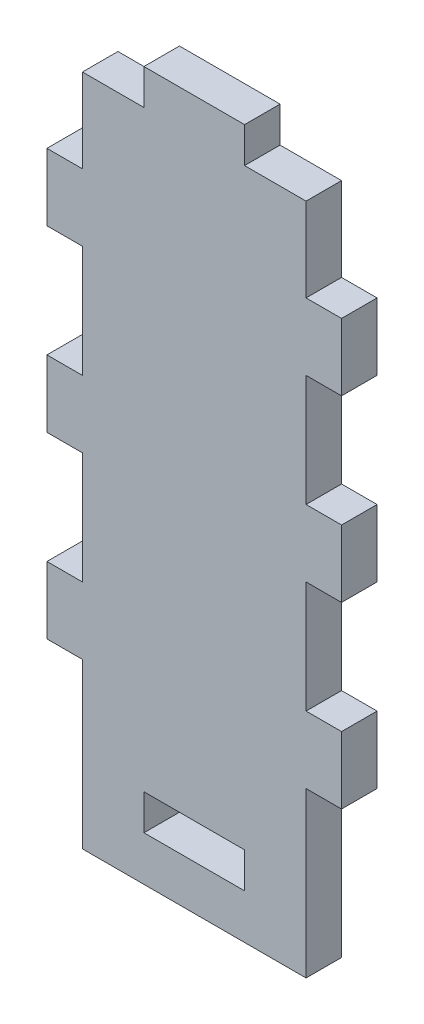
ISO-10303-21;
HEADER;
FILE_DESCRIPTION(('STEP AP214'),'2;1');
FILE_NAME('part.step','',(''),(''),'','','');
FILE_SCHEMA(('AUTOMOTIVE_DESIGN { 1 0 10303 214 1 1 1 1 }'));
ENDSEC;
DATA;
#1=APPLICATION_CONTEXT('core data for automotive mechanical design processes');
#2=APPLICATION_PROTOCOL_DEFINITION('international standard','automotive_design',2000,#1);
#3=PRODUCT_CONTEXT('',#1,'mechanical');
#4=PRODUCT('Part','Part','',(#3));
#5=PRODUCT_RELATED_PRODUCT_CATEGORY('part','',(#4));
#6=PRODUCT_DEFINITION_FORMATION('','',#4);
#7=PRODUCT_DEFINITION_CONTEXT('part definition',#1,'design');
#8=PRODUCT_DEFINITION('design','',#6,#7);
#9=PRODUCT_DEFINITION_SHAPE('','',#8);
#10=(LENGTH_UNIT() NAMED_UNIT(*) SI_UNIT(.MILLI.,.METRE.));
#11=(NAMED_UNIT(*) PLANE_ANGLE_UNIT() SI_UNIT($,.RADIAN.));
#12=(NAMED_UNIT(*) SI_UNIT($,.STERADIAN.) SOLID_ANGLE_UNIT());
#13=UNCERTAINTY_MEASURE_WITH_UNIT(LENGTH_MEASURE(1.E-05),#10,'distance_accuracy_value','');
#14=(GEOMETRIC_REPRESENTATION_CONTEXT(3) GLOBAL_UNCERTAINTY_ASSIGNED_CONTEXT((#13)) GLOBAL_UNIT_ASSIGNED_CONTEXT((#10,
#11,#12)) REPRESENTATION_CONTEXT('',''));
#15=CARTESIAN_POINT('',(0.,0.,0.));
#16=DIRECTION('',(0.,0.,1.));
#17=DIRECTION('',(1.,0.,0.));
#18=AXIS2_PLACEMENT_3D('',#15,#16,#17);
#19=CARTESIAN_POINT('',(0.,0.,1.5875));
#20=DIRECTION('',(1.,0.,0.));
#21=DIRECTION('',(0.,0.,-1.));
#22=AXIS2_PLACEMENT_3D('',#19,#20,#21);
#23=PLANE('',#22);
#24=DIRECTION('',(0.,-1.,0.));
#25=VECTOR('',#24,1.);
#26=CARTESIAN_POINT('',(0.,0.,-1.5875));
#27=LINE('',#26,#25);
#28=CARTESIAN_POINT('',(0.,14.675,-1.5875));
#29=VERTEX_POINT('',#28);
#30=CARTESIAN_POINT('',(0.,0.,-1.5875));
#31=VERTEX_POINT('',#30);
#32=EDGE_CURVE('E315',#29,#31,#27,.T.);
#33=ORIENTED_EDGE('',*,*,#32,.F.);
#34=DIRECTION('',(0.,0.,-1.));
#35=VECTOR('',#34,1.);
#36=CARTESIAN_POINT('',(0.,14.675,1.5875));
#37=LINE('',#36,#35);
#38=CARTESIAN_POINT('',(0.,14.675,1.5875));
#39=VERTEX_POINT('',#38);
#40=EDGE_CURVE('E11',#39,#29,#37,.T.);
#41=ORIENTED_EDGE('',*,*,#40,.F.);
#42=DIRECTION('',(0.,-1.,0.));
#43=VECTOR('',#42,1.);
#44=CARTESIAN_POINT('',(0.,0.,1.5875));
#45=LINE('',#44,#43);
#46=CARTESIAN_POINT('',(0.,0.,1.5875));
#47=VERTEX_POINT('',#46);
#48=EDGE_CURVE('E647',#39,#47,#45,.T.);
#49=ORIENTED_EDGE('',*,*,#48,.T.);
#50=DIRECTION('',(0.,0.,-1.));
#51=VECTOR('',#50,1.);
#52=CARTESIAN_POINT('',(0.,0.,1.5875));
#53=LINE('',#52,#51);
#54=EDGE_CURVE('E172',#47,#31,#53,.T.);
#55=ORIENTED_EDGE('',*,*,#54,.T.);
#56=EDGE_LOOP('',(#33,#41,#49,#55));
#57=FACE_BOUND('',#56,.T.);
#58=ADVANCED_FACE('F35',(#57),#23,.T.);
#59=CARTESIAN_POINT('',(0.,14.675,1.5875));
#60=DIRECTION('',(0.,1.,0.));
#61=DIRECTION('',(-1.,0.,0.));
#62=AXIS2_PLACEMENT_3D('',#59,#60,#61);
#63=PLANE('',#62);
#64=DIRECTION('',(1.,0.,0.));
#65=VECTOR('',#64,1.);
#66=CARTESIAN_POINT('',(0.,14.675,-1.5875));
#67=LINE('',#66,#65);
#68=CARTESIAN_POINT('',(3.175,14.675,-1.5875));
#69=VERTEX_POINT('',#68);
#70=EDGE_CURVE('E318',#29,#69,#67,.T.);
#71=ORIENTED_EDGE('',*,*,#70,.T.);
#72=DIRECTION('',(0.,0.,-1.));
#73=VECTOR('',#72,1.);
#74=CARTESIAN_POINT('',(3.175,14.675,1.5875));
#75=LINE('',#74,#73);
#76=CARTESIAN_POINT('',(3.175,14.675,1.5875));
#77=VERTEX_POINT('',#76);
#78=EDGE_CURVE('E45',#77,#69,#75,.T.);
#79=ORIENTED_EDGE('',*,*,#78,.F.);
#80=DIRECTION('',(1.,0.,0.));
#81=VECTOR('',#80,1.);
#82=CARTESIAN_POINT('',(0.,14.675,1.5875));
#83=LINE('',#82,#81);
#84=EDGE_CURVE('E649',#39,#77,#83,.T.);
#85=ORIENTED_EDGE('',*,*,#84,.F.);
#86=ORIENTED_EDGE('',*,*,#40,.T.);
#87=EDGE_LOOP('',(#71,#79,#85,#86));
#88=FACE_BOUND('',#87,.T.);
#89=ADVANCED_FACE('F513',(#88),#63,.F.);
#90=CARTESIAN_POINT('',(3.175,0.,1.5875));
#91=DIRECTION('',(-1.,0.,0.));
#92=DIRECTION('',(0.,0.,1.));
#93=AXIS2_PLACEMENT_3D('',#90,#91,#92);
#94=PLANE('',#93);
#95=DIRECTION('',(0.,1.,0.));
#96=VECTOR('',#95,1.);
#97=CARTESIAN_POINT('',(3.175,0.,-1.5875));
#98=LINE('',#97,#96);
#99=CARTESIAN_POINT('',(3.175,20.675,-1.5875));
#100=VERTEX_POINT('',#99);
#101=EDGE_CURVE('E321',#69,#100,#98,.T.);
#102=ORIENTED_EDGE('',*,*,#101,.T.);
#103=DIRECTION('',(0.,0.,-1.));
#104=VECTOR('',#103,1.);
#105=CARTESIAN_POINT('',(3.175,20.675,1.5875));
#106=LINE('',#105,#104);
#107=CARTESIAN_POINT('',(3.175,20.675,1.5875));
#108=VERTEX_POINT('',#107);
#109=EDGE_CURVE('E475',#108,#100,#106,.T.);
#110=ORIENTED_EDGE('',*,*,#109,.F.);
#111=DIRECTION('',(0.,1.,0.));
#112=VECTOR('',#111,1.);
#113=CARTESIAN_POINT('',(3.175,0.,1.5875));
#114=LINE('',#113,#112);
#115=EDGE_CURVE('E652',#77,#108,#114,.T.);
#116=ORIENTED_EDGE('',*,*,#115,.F.);
#117=ORIENTED_EDGE('',*,*,#78,.T.);
#118=EDGE_LOOP('',(#102,#110,#116,#117));
#119=FACE_BOUND('',#118,.T.);
#120=ADVANCED_FACE('F518',(#119),#94,.F.);
#121=CARTESIAN_POINT('',(0.,20.675,1.5875));
#122=DIRECTION('',(0.,-1.,0.));
#123=DIRECTION('',(1.,0.,0.));
#124=AXIS2_PLACEMENT_3D('',#121,#122,#123);
#125=PLANE('',#124);
#126=DIRECTION('',(-1.,0.,0.));
#127=VECTOR('',#126,1.);
#128=CARTESIAN_POINT('',(0.,20.675,-1.5875));
#129=LINE('',#128,#127);
#130=CARTESIAN_POINT('',(0.,20.675,-1.5875));
#131=VERTEX_POINT('',#130);
#132=EDGE_CURVE('E324',#100,#131,#129,.T.);
#133=ORIENTED_EDGE('',*,*,#132,.T.);
#134=DIRECTION('',(0.,0.,-1.));
#135=VECTOR('',#134,1.);
#136=CARTESIAN_POINT('',(0.,20.675,1.5875));
#137=LINE('',#136,#135);
#138=CARTESIAN_POINT('',(0.,20.675,1.5875));
#139=VERTEX_POINT('',#138);
#140=EDGE_CURVE('E472',#139,#131,#137,.T.);
#141=ORIENTED_EDGE('',*,*,#140,.F.);
#142=DIRECTION('',(-1.,0.,0.));
#143=VECTOR('',#142,1.);
#144=CARTESIAN_POINT('',(0.,20.675,1.5875));
#145=LINE('',#144,#143);
#146=EDGE_CURVE('E655',#108,#139,#145,.T.);
#147=ORIENTED_EDGE('',*,*,#146,.F.);
#148=ORIENTED_EDGE('',*,*,#109,.T.);
#149=EDGE_LOOP('',(#133,#141,#147,#148));
#150=FACE_BOUND('',#149,.T.);
#151=ADVANCED_FACE('F524',(#150),#125,.F.);
#152=CARTESIAN_POINT('',(0.,0.,1.5875));
#153=DIRECTION('',(-1.,0.,0.));
#154=DIRECTION('',(0.,0.,1.));
#155=AXIS2_PLACEMENT_3D('',#152,#153,#154);
#156=PLANE('',#155);
#157=DIRECTION('',(0.,1.,0.));
#158=VECTOR('',#157,1.);
#159=CARTESIAN_POINT('',(0.,0.,-1.5875));
#160=LINE('',#159,#158);
#161=CARTESIAN_POINT('',(0.,30.675,-1.5875));
#162=VERTEX_POINT('',#161);
#163=EDGE_CURVE('E327',#131,#162,#160,.T.);
#164=ORIENTED_EDGE('',*,*,#163,.T.);
#165=DIRECTION('',(0.,0.,-1.));
#166=VECTOR('',#165,1.);
#167=CARTESIAN_POINT('',(0.,30.675,1.5875));
#168=LINE('',#167,#166);
#169=CARTESIAN_POINT('',(0.,30.675,1.5875));
#170=VERTEX_POINT('',#169);
#171=EDGE_CURVE('E469',#170,#162,#168,.T.);
#172=ORIENTED_EDGE('',*,*,#171,.F.);
#173=DIRECTION('',(0.,1.,0.));
#174=VECTOR('',#173,1.);
#175=CARTESIAN_POINT('',(0.,0.,1.5875));
#176=LINE('',#175,#174);
#177=EDGE_CURVE('E658',#139,#170,#176,.T.);
#178=ORIENTED_EDGE('',*,*,#177,.F.);
#179=ORIENTED_EDGE('',*,*,#140,.T.);
#180=EDGE_LOOP('',(#164,#172,#178,#179));
#181=FACE_BOUND('',#180,.T.);
#182=ADVANCED_FACE('F528',(#181),#156,.F.);
#183=CARTESIAN_POINT('',(0.,30.675,1.5875));
#184=DIRECTION('',(0.,1.,0.));
#185=DIRECTION('',(0.,0.,1.));
#186=AXIS2_PLACEMENT_3D('',#183,#184,#185);
#187=PLANE('',#186);
#188=DIRECTION('',(1.,0.,0.));
#189=VECTOR('',#188,1.);
#190=CARTESIAN_POINT('',(0.,30.675,-1.5875));
#191=LINE('',#190,#189);
#192=CARTESIAN_POINT('',(3.175,30.675,-1.5875));
#193=VERTEX_POINT('',#192);
#194=EDGE_CURVE('E330',#162,#193,#191,.T.);
#195=ORIENTED_EDGE('',*,*,#194,.T.);
#196=DIRECTION('',(0.,0.,-1.));
#197=VECTOR('',#196,1.);
#198=CARTESIAN_POINT('',(3.175,30.675,1.5875));
#199=LINE('',#198,#197);
#200=CARTESIAN_POINT('',(3.175,30.675,1.5875));
#201=VERTEX_POINT('',#200);
#202=EDGE_CURVE('E466',#201,#193,#199,.T.);
#203=ORIENTED_EDGE('',*,*,#202,.F.);
#204=DIRECTION('',(1.,0.,0.));
#205=VECTOR('',#204,1.);
#206=CARTESIAN_POINT('',(0.,30.675,1.5875));
#207=LINE('',#206,#205);
#208=EDGE_CURVE('E661',#170,#201,#207,.T.);
#209=ORIENTED_EDGE('',*,*,#208,.F.);
#210=ORIENTED_EDGE('',*,*,#171,.T.);
#211=EDGE_LOOP('',(#195,#203,#209,#210));
#212=FACE_BOUND('',#211,.T.);
#213=ADVANCED_FACE('F532',(#212),#187,.F.);
#214=CARTESIAN_POINT('',(3.175,0.,1.5875));
#215=DIRECTION('',(-1.,0.,0.));
#216=DIRECTION('',(0.,0.,1.));
#217=AXIS2_PLACEMENT_3D('',#214,#215,#216);
#218=PLANE('',#217);
#219=DIRECTION('',(0.,1.,0.));
#220=VECTOR('',#219,1.);
#221=CARTESIAN_POINT('',(3.175,0.,-1.5875));
#222=LINE('',#221,#220);
#223=CARTESIAN_POINT('',(3.175,36.675,-1.5875));
#224=VERTEX_POINT('',#223);
#225=EDGE_CURVE('E333',#193,#224,#222,.T.);
#226=ORIENTED_EDGE('',*,*,#225,.T.);
#227=DIRECTION('',(0.,0.,-1.));
#228=VECTOR('',#227,1.);
#229=CARTESIAN_POINT('',(3.175,36.675,1.5875));
#230=LINE('',#229,#228);
#231=CARTESIAN_POINT('',(3.175,36.675,1.5875));
#232=VERTEX_POINT('',#231);
#233=EDGE_CURVE('E463',#232,#224,#230,.T.);
#234=ORIENTED_EDGE('',*,*,#233,.F.);
#235=DIRECTION('',(0.,1.,0.));
#236=VECTOR('',#235,1.);
#237=CARTESIAN_POINT('',(3.175,0.,1.5875));
#238=LINE('',#237,#236);
#239=EDGE_CURVE('E664',#201,#232,#238,.T.);
#240=ORIENTED_EDGE('',*,*,#239,.F.);
#241=ORIENTED_EDGE('',*,*,#202,.T.);
#242=EDGE_LOOP('',(#226,#234,#240,#241));
#243=FACE_BOUND('',#242,.T.);
#244=ADVANCED_FACE('F536',(#243),#218,.F.);
#245=CARTESIAN_POINT('',(0.,36.675,1.5875));
#246=DIRECTION('',(0.,-1.,0.));
#247=DIRECTION('',(0.,0.,-1.));
#248=AXIS2_PLACEMENT_3D('',#245,#246,#247);
#249=PLANE('',#248);
#250=DIRECTION('',(-1.,0.,0.));
#251=VECTOR('',#250,1.);
#252=CARTESIAN_POINT('',(0.,36.675,-1.5875));
#253=LINE('',#252,#251);
#254=CARTESIAN_POINT('',(0.,36.675,-1.5875));
#255=VERTEX_POINT('',#254);
#256=EDGE_CURVE('E336',#224,#255,#253,.T.);
#257=ORIENTED_EDGE('',*,*,#256,.T.);
#258=DIRECTION('',(0.,0.,-1.));
#259=VECTOR('',#258,1.);
#260=CARTESIAN_POINT('',(0.,36.675,1.5875));
#261=LINE('',#260,#259);
#262=CARTESIAN_POINT('',(0.,36.675,1.5875));
#263=VERTEX_POINT('',#262);
#264=EDGE_CURVE('E460',#263,#255,#261,.T.);
#265=ORIENTED_EDGE('',*,*,#264,.F.);
#266=DIRECTION('',(-1.,0.,0.));
#267=VECTOR('',#266,1.);
#268=CARTESIAN_POINT('',(0.,36.675,1.5875));
#269=LINE('',#268,#267);
#270=EDGE_CURVE('E667',#232,#263,#269,.T.);
#271=ORIENTED_EDGE('',*,*,#270,.F.);
#272=ORIENTED_EDGE('',*,*,#233,.T.);
#273=EDGE_LOOP('',(#257,#265,#271,#272));
#274=FACE_BOUND('',#273,.T.);
#275=ADVANCED_FACE('F540',(#274),#249,.F.);
#276=CARTESIAN_POINT('',(0.,0.,1.5875));
#277=DIRECTION('',(-1.,0.,0.));
#278=DIRECTION('',(0.,0.,1.));
#279=AXIS2_PLACEMENT_3D('',#276,#277,#278);
#280=PLANE('',#279);
#281=DIRECTION('',(0.,1.,0.));
#282=VECTOR('',#281,1.);
#283=CARTESIAN_POINT('',(0.,0.,-1.5875));
#284=LINE('',#283,#282);
#285=CARTESIAN_POINT('',(0.,46.675,-1.5875));
#286=VERTEX_POINT('',#285);
#287=EDGE_CURVE('E339',#255,#286,#284,.T.);
#288=ORIENTED_EDGE('',*,*,#287,.T.);
#289=DIRECTION('',(0.,0.,-1.));
#290=VECTOR('',#289,1.);
#291=CARTESIAN_POINT('',(0.,46.675,1.5875));
#292=LINE('',#291,#290);
#293=CARTESIAN_POINT('',(0.,46.675,1.5875));
#294=VERTEX_POINT('',#293);
#295=EDGE_CURVE('E457',#294,#286,#292,.T.);
#296=ORIENTED_EDGE('',*,*,#295,.F.);
#297=DIRECTION('',(0.,1.,0.));
#298=VECTOR('',#297,1.);
#299=CARTESIAN_POINT('',(0.,0.,1.5875));
#300=LINE('',#299,#298);
#301=EDGE_CURVE('E670',#263,#294,#300,.T.);
#302=ORIENTED_EDGE('',*,*,#301,.F.);
#303=ORIENTED_EDGE('',*,*,#264,.T.);
#304=EDGE_LOOP('',(#288,#296,#302,#303));
#305=FACE_BOUND('',#304,.T.);
#306=ADVANCED_FACE('F544',(#305),#280,.F.);
#307=CARTESIAN_POINT('',(1.02007204083424E-13,46.675,1.5875));
#308=DIRECTION('',(0.,1.,0.));
#309=DIRECTION('',(-1.,0.,0.));
#310=AXIS2_PLACEMENT_3D('',#307,#308,#309);
#311=PLANE('',#310);
#312=DIRECTION('',(1.,0.,0.));
#313=VECTOR('',#312,1.);
#314=CARTESIAN_POINT('',(1.02007204083424E-13,46.675,-1.5875));
#315=LINE('',#314,#313);
#316=CARTESIAN_POINT('',(3.175,46.675,-1.5875));
#317=VERTEX_POINT('',#316);
#318=EDGE_CURVE('E342',#286,#317,#315,.T.);
#319=ORIENTED_EDGE('',*,*,#318,.T.);
#320=DIRECTION('',(0.,0.,-1.));
#321=VECTOR('',#320,1.);
#322=CARTESIAN_POINT('',(3.175,46.675,1.5875));
#323=LINE('',#322,#321);
#324=CARTESIAN_POINT('',(3.175,46.675,1.5875));
#325=VERTEX_POINT('',#324);
#326=EDGE_CURVE('E454',#325,#317,#323,.T.);
#327=ORIENTED_EDGE('',*,*,#326,.F.);
#328=DIRECTION('',(1.,0.,0.));
#329=VECTOR('',#328,1.);
#330=CARTESIAN_POINT('',(1.02007204083424E-13,46.675,1.5875));
#331=LINE('',#330,#329);
#332=EDGE_CURVE('E673',#294,#325,#331,.T.);
#333=ORIENTED_EDGE('',*,*,#332,.F.);
#334=ORIENTED_EDGE('',*,*,#295,.T.);
#335=EDGE_LOOP('',(#319,#327,#333,#334));
#336=FACE_BOUND('',#335,.T.);
#337=ADVANCED_FACE('F548',(#336),#311,.F.);
#338=CARTESIAN_POINT('',(3.175,0.,1.5875));
#339=DIRECTION('',(-1.,0.,0.));
#340=DIRECTION('',(0.,0.,1.));
#341=AXIS2_PLACEMENT_3D('',#338,#339,#340);
#342=PLANE('',#341);
#343=DIRECTION('',(0.,1.,0.));
#344=VECTOR('',#343,1.);
#345=CARTESIAN_POINT('',(3.175,0.,-1.5875));
#346=LINE('',#345,#344);
#347=CARTESIAN_POINT('',(3.175,52.675,-1.5875));
#348=VERTEX_POINT('',#347);
#349=EDGE_CURVE('E345',#317,#348,#346,.T.);
#350=ORIENTED_EDGE('',*,*,#349,.T.);
#351=DIRECTION('',(0.,0.,-1.));
#352=VECTOR('',#351,1.);
#353=CARTESIAN_POINT('',(3.175,52.675,1.5875));
#354=LINE('',#353,#352);
#355=CARTESIAN_POINT('',(3.175,52.675,1.5875));
#356=VERTEX_POINT('',#355);
#357=EDGE_CURVE('E451',#356,#348,#354,.T.);
#358=ORIENTED_EDGE('',*,*,#357,.F.);
#359=DIRECTION('',(0.,1.,0.));
#360=VECTOR('',#359,1.);
#361=CARTESIAN_POINT('',(3.175,0.,1.5875));
#362=LINE('',#361,#360);
#363=EDGE_CURVE('E676',#325,#356,#362,.T.);
#364=ORIENTED_EDGE('',*,*,#363,.F.);
#365=ORIENTED_EDGE('',*,*,#326,.T.);
#366=EDGE_LOOP('',(#350,#358,#364,#365));
#367=FACE_BOUND('',#366,.T.);
#368=ADVANCED_FACE('F552',(#367),#342,.F.);
#369=CARTESIAN_POINT('',(-1.15120074453012E-13,52.675,1.5875));
#370=DIRECTION('',(0.,-1.,0.));
#371=DIRECTION('',(1.,0.,0.));
#372=AXIS2_PLACEMENT_3D('',#369,#370,#371);
#373=PLANE('',#372);
#374=DIRECTION('',(-1.,0.,0.));
#375=VECTOR('',#374,1.);
#376=CARTESIAN_POINT('',(-1.15120074453012E-13,52.675,-1.5875));
#377=LINE('',#376,#375);
#378=CARTESIAN_POINT('',(0.,52.675,-1.5875));
#379=VERTEX_POINT('',#378);
#380=EDGE_CURVE('E348',#348,#379,#377,.T.);
#381=ORIENTED_EDGE('',*,*,#380,.T.);
#382=DIRECTION('',(0.,0.,-1.));
#383=VECTOR('',#382,1.);
#384=CARTESIAN_POINT('',(0.,52.675,1.5875));
#385=LINE('',#384,#383);
#386=CARTESIAN_POINT('',(0.,52.675,1.5875));
#387=VERTEX_POINT('',#386);
#388=EDGE_CURVE('E448',#387,#379,#385,.T.);
#389=ORIENTED_EDGE('',*,*,#388,.F.);
#390=DIRECTION('',(-1.,0.,0.));
#391=VECTOR('',#390,1.);
#392=CARTESIAN_POINT('',(-1.15120074453012E-13,52.675,1.5875));
#393=LINE('',#392,#391);
#394=EDGE_CURVE('E679',#356,#387,#393,.T.);
#395=ORIENTED_EDGE('',*,*,#394,.F.);
#396=ORIENTED_EDGE('',*,*,#357,.T.);
#397=EDGE_LOOP('',(#381,#389,#395,#396));
#398=FACE_BOUND('',#397,.T.);
#399=ADVANCED_FACE('F556',(#398),#373,.F.);
#400=CARTESIAN_POINT('',(0.,0.,1.5875));
#401=DIRECTION('',(-1.,0.,0.));
#402=DIRECTION('',(0.,-1.,0.));
#403=AXIS2_PLACEMENT_3D('',#400,#401,#402);
#404=PLANE('',#403);
#405=DIRECTION('',(0.,1.,0.));
#406=VECTOR('',#405,1.);
#407=CARTESIAN_POINT('',(0.,0.,-1.5875));
#408=LINE('',#407,#406);
#409=CARTESIAN_POINT('',(0.,60.175,-1.5875));
#410=VERTEX_POINT('',#409);
#411=EDGE_CURVE('E351',#379,#410,#408,.T.);
#412=ORIENTED_EDGE('',*,*,#411,.T.);
#413=DIRECTION('',(0.,0.,-1.));
#414=VECTOR('',#413,1.);
#415=CARTESIAN_POINT('',(0.,60.175,1.5875));
#416=LINE('',#415,#414);
#417=CARTESIAN_POINT('',(0.,60.175,1.5875));
#418=VERTEX_POINT('',#417);
#419=EDGE_CURVE('E445',#418,#410,#416,.T.);
#420=ORIENTED_EDGE('',*,*,#419,.F.);
#421=DIRECTION('',(0.,1.,0.));
#422=VECTOR('',#421,1.);
#423=CARTESIAN_POINT('',(0.,0.,1.5875));
#424=LINE('',#423,#422);
#425=EDGE_CURVE('E682',#387,#418,#424,.T.);
#426=ORIENTED_EDGE('',*,*,#425,.F.);
#427=ORIENTED_EDGE('',*,*,#388,.T.);
#428=EDGE_LOOP('',(#412,#420,#426,#427));
#429=FACE_BOUND('',#428,.T.);
#430=ADVANCED_FACE('F560',(#429),#404,.F.);
#431=CARTESIAN_POINT('',(-2.27753422182337E-13,60.175,1.5875));
#432=DIRECTION('',(0.,-1.,0.));
#433=DIRECTION('',(1.,0.,0.));
#434=AXIS2_PLACEMENT_3D('',#431,#432,#433);
#435=PLANE('',#434);
#436=DIRECTION('',(-1.,0.,0.));
#437=VECTOR('',#436,1.);
#438=CARTESIAN_POINT('',(-2.27753422182337E-13,60.175,-1.5875));
#439=LINE('',#438,#437);
#440=CARTESIAN_POINT('',(-5.50000000000001,60.175,-1.5875));
#441=VERTEX_POINT('',#440);
#442=EDGE_CURVE('E354',#410,#441,#439,.T.);
#443=ORIENTED_EDGE('',*,*,#442,.T.);
#444=DIRECTION('',(0.,0.,-1.));
#445=VECTOR('',#444,1.);
#446=CARTESIAN_POINT('',(-5.50000000000001,60.175,1.5875));
#447=LINE('',#446,#445);
#448=CARTESIAN_POINT('',(-5.50000000000001,60.175,1.5875));
#449=VERTEX_POINT('',#448);
#450=EDGE_CURVE('E442',#449,#441,#447,.T.);
#451=ORIENTED_EDGE('',*,*,#450,.F.);
#452=DIRECTION('',(-1.,0.,0.));
#453=VECTOR('',#452,1.);
#454=CARTESIAN_POINT('',(-2.27753422182337E-13,60.175,1.5875));
#455=LINE('',#454,#453);
#456=EDGE_CURVE('E685',#418,#449,#455,.T.);
#457=ORIENTED_EDGE('',*,*,#456,.F.);
#458=ORIENTED_EDGE('',*,*,#419,.T.);
#459=EDGE_LOOP('',(#443,#451,#457,#458));
#460=FACE_BOUND('',#459,.T.);
#461=ADVANCED_FACE('F564',(#460),#435,.F.);
#462=CARTESIAN_POINT('',(-5.49999999999994,0.,1.5875));
#463=DIRECTION('',(-1.,0.,0.));
#464=DIRECTION('',(0.,-1.,0.));
#465=AXIS2_PLACEMENT_3D('',#462,#463,#464);
#466=PLANE('',#465);
#467=DIRECTION('',(0.,1.,0.));
#468=VECTOR('',#467,1.);
#469=CARTESIAN_POINT('',(-5.49999999999994,0.,-1.5875));
#470=LINE('',#469,#468);
#471=CARTESIAN_POINT('',(-5.50000000000001,63.35,-1.5875));
#472=VERTEX_POINT('',#471);
#473=EDGE_CURVE('E357',#441,#472,#470,.T.);
#474=ORIENTED_EDGE('',*,*,#473,.T.);
#475=DIRECTION('',(0.,0.,-1.));
#476=VECTOR('',#475,1.);
#477=CARTESIAN_POINT('',(-5.50000000000001,63.35,1.5875));
#478=LINE('',#477,#476);
#479=CARTESIAN_POINT('',(-5.50000000000001,63.35,1.5875));
#480=VERTEX_POINT('',#479);
#481=EDGE_CURVE('E439',#480,#472,#478,.T.);
#482=ORIENTED_EDGE('',*,*,#481,.F.);
#483=DIRECTION('',(0.,1.,0.));
#484=VECTOR('',#483,1.);
#485=CARTESIAN_POINT('',(-5.49999999999994,0.,1.5875));
#486=LINE('',#485,#484);
#487=EDGE_CURVE('E688',#449,#480,#486,.T.);
#488=ORIENTED_EDGE('',*,*,#487,.F.);
#489=ORIENTED_EDGE('',*,*,#450,.T.);
#490=EDGE_LOOP('',(#474,#482,#488,#489));
#491=FACE_BOUND('',#490,.T.);
#492=ADVANCED_FACE('F568',(#491),#466,.F.);
#493=CARTESIAN_POINT('',(0.,63.35,1.5875));
#494=DIRECTION('',(0.,-1.,0.));
#495=DIRECTION('',(0.,0.,-1.));
#496=AXIS2_PLACEMENT_3D('',#493,#494,#495);
#497=PLANE('',#496);
#498=DIRECTION('',(-1.,0.,0.));
#499=VECTOR('',#498,1.);
#500=CARTESIAN_POINT('',(0.,63.35,-1.5875));
#501=LINE('',#500,#499);
#502=CARTESIAN_POINT('',(-14.5,63.35,-1.5875));
#503=VERTEX_POINT('',#502);
#504=EDGE_CURVE('E360',#472,#503,#501,.T.);
#505=ORIENTED_EDGE('',*,*,#504,.T.);
#506=DIRECTION('',(0.,0.,-1.));
#507=VECTOR('',#506,1.);
#508=CARTESIAN_POINT('',(-14.5,63.35,1.5875));
#509=LINE('',#508,#507);
#510=CARTESIAN_POINT('',(-14.5,63.35,1.5875));
#511=VERTEX_POINT('',#510);
#512=EDGE_CURVE('E436',#511,#503,#509,.T.);
#513=ORIENTED_EDGE('',*,*,#512,.F.);
#514=DIRECTION('',(-1.,0.,0.));
#515=VECTOR('',#514,1.);
#516=CARTESIAN_POINT('',(0.,63.35,1.5875));
#517=LINE('',#516,#515);
#518=EDGE_CURVE('E691',#480,#511,#517,.T.);
#519=ORIENTED_EDGE('',*,*,#518,.F.);
#520=ORIENTED_EDGE('',*,*,#481,.T.);
#521=EDGE_LOOP('',(#505,#513,#519,#520));
#522=FACE_BOUND('',#521,.T.);
#523=ADVANCED_FACE('F572',(#522),#497,.F.);
#524=CARTESIAN_POINT('',(-14.5,0.,1.5875));
#525=DIRECTION('',(1.,0.,0.));
#526=DIRECTION('',(0.,0.,-1.));
#527=AXIS2_PLACEMENT_3D('',#524,#525,#526);
#528=PLANE('',#527);
#529=DIRECTION('',(0.,-1.,0.));
#530=VECTOR('',#529,1.);
#531=CARTESIAN_POINT('',(-14.5,0.,-1.5875));
#532=LINE('',#531,#530);
#533=CARTESIAN_POINT('',(-14.5,60.175,-1.5875));
#534=VERTEX_POINT('',#533);
#535=EDGE_CURVE('E363',#503,#534,#532,.T.);
#536=ORIENTED_EDGE('',*,*,#535,.T.);
#537=DIRECTION('',(0.,0.,-1.));
#538=VECTOR('',#537,1.);
#539=CARTESIAN_POINT('',(-14.5,60.175,1.5875));
#540=LINE('',#539,#538);
#541=CARTESIAN_POINT('',(-14.5,60.175,1.5875));
#542=VERTEX_POINT('',#541);
#543=EDGE_CURVE('E433',#542,#534,#540,.T.);
#544=ORIENTED_EDGE('',*,*,#543,.F.);
#545=DIRECTION('',(0.,-1.,0.));
#546=VECTOR('',#545,1.);
#547=CARTESIAN_POINT('',(-14.5,0.,1.5875));
#548=LINE('',#547,#546);
#549=EDGE_CURVE('E694',#511,#542,#548,.T.);
#550=ORIENTED_EDGE('',*,*,#549,.F.);
#551=ORIENTED_EDGE('',*,*,#512,.T.);
#552=EDGE_LOOP('',(#536,#544,#550,#551));
#553=FACE_BOUND('',#552,.T.);
#554=ADVANCED_FACE('F576',(#553),#528,.F.);
#555=CARTESIAN_POINT('',(0.,60.175,1.5875));
#556=DIRECTION('',(0.,-1.,0.));
#557=DIRECTION('',(0.,0.,-1.));
#558=AXIS2_PLACEMENT_3D('',#555,#556,#557);
#559=PLANE('',#558);
#560=DIRECTION('',(-1.,0.,0.));
#561=VECTOR('',#560,1.);
#562=CARTESIAN_POINT('',(0.,60.175,-1.5875));
#563=LINE('',#562,#561);
#564=CARTESIAN_POINT('',(-20.,60.175,-1.5875));
#565=VERTEX_POINT('',#564);
#566=EDGE_CURVE('E366',#534,#565,#563,.T.);
#567=ORIENTED_EDGE('',*,*,#566,.T.);
#568=DIRECTION('',(0.,0.,-1.));
#569=VECTOR('',#568,1.);
#570=CARTESIAN_POINT('',(-20.,60.175,1.5875));
#571=LINE('',#570,#569);
#572=CARTESIAN_POINT('',(-20.,60.175,1.5875));
#573=VERTEX_POINT('',#572);
#574=EDGE_CURVE('E431',#573,#565,#571,.T.);
#575=ORIENTED_EDGE('',*,*,#574,.F.);
#576=DIRECTION('',(-1.,0.,0.));
#577=VECTOR('',#576,1.);
#578=CARTESIAN_POINT('',(0.,60.175,1.5875));
#579=LINE('',#578,#577);
#580=EDGE_CURVE('E697',#542,#573,#579,.T.);
#581=ORIENTED_EDGE('',*,*,#580,.F.);
#582=ORIENTED_EDGE('',*,*,#543,.T.);
#583=EDGE_LOOP('',(#567,#575,#581,#582));
#584=FACE_BOUND('',#583,.T.);
#585=ADVANCED_FACE('F580',(#584),#559,.F.);
#586=CARTESIAN_POINT('',(-20.,0.,1.5875));
#587=DIRECTION('',(-1.,0.,0.));
#588=DIRECTION('',(0.,0.,1.));
#589=AXIS2_PLACEMENT_3D('',#586,#587,#588);
#590=PLANE('',#589);
#591=DIRECTION('',(0.,1.,0.));
#592=VECTOR('',#591,1.);
#593=CARTESIAN_POINT('',(-20.,0.,-1.5875));
#594=LINE('',#593,#592);
#595=CARTESIAN_POINT('',(-20.,52.675,-1.5875));
#596=VERTEX_POINT('',#595);
#597=EDGE_CURVE('E369',#596,#565,#594,.T.);
#598=ORIENTED_EDGE('',*,*,#597,.F.);
#599=DIRECTION('',(0.,0.,-1.));
#600=VECTOR('',#599,1.);
#601=CARTESIAN_POINT('',(-20.,52.675,1.5875));
#602=LINE('',#601,#600);
#603=CARTESIAN_POINT('',(-20.,52.675,1.5875));
#604=VERTEX_POINT('',#603);
#605=EDGE_CURVE('E429',#604,#596,#602,.T.);
#606=ORIENTED_EDGE('',*,*,#605,.F.);
#607=DIRECTION('',(0.,1.,0.));
#608=VECTOR('',#607,1.);
#609=CARTESIAN_POINT('',(-20.,0.,1.5875));
#610=LINE('',#609,#608);
#611=EDGE_CURVE('E699',#604,#573,#610,.T.);
#612=ORIENTED_EDGE('',*,*,#611,.T.);
#613=ORIENTED_EDGE('',*,*,#574,.T.);
#614=EDGE_LOOP('',(#598,#606,#612,#613));
#615=FACE_BOUND('',#614,.T.);
#616=ADVANCED_FACE('F584',(#615),#590,.T.);
#617=CARTESIAN_POINT('',(0.,52.675,1.5875));
#618=DIRECTION('',(0.,1.,0.));
#619=DIRECTION('',(0.,0.,1.));
#620=AXIS2_PLACEMENT_3D('',#617,#618,#619);
#621=PLANE('',#620);
#622=DIRECTION('',(1.,0.,0.));
#623=VECTOR('',#622,1.);
#624=CARTESIAN_POINT('',(0.,52.675,-1.5875));
#625=LINE('',#624,#623);
#626=CARTESIAN_POINT('',(-23.175,52.675,-1.5875));
#627=VERTEX_POINT('',#626);
#628=EDGE_CURVE('E372',#627,#596,#625,.T.);
#629=ORIENTED_EDGE('',*,*,#628,.F.);
#630=DIRECTION('',(0.,0.,-1.));
#631=VECTOR('',#630,1.);
#632=CARTESIAN_POINT('',(-23.175,52.675,1.5875));
#633=LINE('',#632,#631);
#634=CARTESIAN_POINT('',(-23.175,52.675,1.5875));
#635=VERTEX_POINT('',#634);
#636=EDGE_CURVE('E427',#635,#627,#633,.T.);
#637=ORIENTED_EDGE('',*,*,#636,.F.);
#638=DIRECTION('',(1.,0.,0.));
#639=VECTOR('',#638,1.);
#640=CARTESIAN_POINT('',(0.,52.675,1.5875));
#641=LINE('',#640,#639);
#642=EDGE_CURVE('E702',#635,#604,#641,.T.);
#643=ORIENTED_EDGE('',*,*,#642,.T.);
#644=ORIENTED_EDGE('',*,*,#605,.T.);
#645=EDGE_LOOP('',(#629,#637,#643,#644));
#646=FACE_BOUND('',#645,.T.);
#647=ADVANCED_FACE('F588',(#646),#621,.T.);
#648=CARTESIAN_POINT('',(-23.175,0.,1.5875));
#649=DIRECTION('',(-1.,0.,0.));
#650=DIRECTION('',(0.,0.,1.));
#651=AXIS2_PLACEMENT_3D('',#648,#649,#650);
#652=PLANE('',#651);
#653=DIRECTION('',(0.,1.,0.));
#654=VECTOR('',#653,1.);
#655=CARTESIAN_POINT('',(-23.175,0.,-1.5875));
#656=LINE('',#655,#654);
#657=CARTESIAN_POINT('',(-23.175,46.675,-1.5875));
#658=VERTEX_POINT('',#657);
#659=EDGE_CURVE('E375',#658,#627,#656,.T.);
#660=ORIENTED_EDGE('',*,*,#659,.F.);
#661=DIRECTION('',(0.,0.,-1.));
#662=VECTOR('',#661,1.);
#663=CARTESIAN_POINT('',(-23.175,46.675,1.5875));
#664=LINE('',#663,#662);
#665=CARTESIAN_POINT('',(-23.175,46.675,1.5875));
#666=VERTEX_POINT('',#665);
#667=EDGE_CURVE('E425',#666,#658,#664,.T.);
#668=ORIENTED_EDGE('',*,*,#667,.F.);
#669=DIRECTION('',(0.,1.,0.));
#670=VECTOR('',#669,1.);
#671=CARTESIAN_POINT('',(-23.175,0.,1.5875));
#672=LINE('',#671,#670);
#673=EDGE_CURVE('E705',#666,#635,#672,.T.);
#674=ORIENTED_EDGE('',*,*,#673,.T.);
#675=ORIENTED_EDGE('',*,*,#636,.T.);
#676=EDGE_LOOP('',(#660,#668,#674,#675));
#677=FACE_BOUND('',#676,.T.);
#678=ADVANCED_FACE('F592',(#677),#652,.T.);
#679=CARTESIAN_POINT('',(0.,46.675,1.5875));
#680=DIRECTION('',(0.,-1.,0.));
#681=DIRECTION('',(0.,0.,-1.));
#682=AXIS2_PLACEMENT_3D('',#679,#680,#681);
#683=PLANE('',#682);
#684=DIRECTION('',(-1.,0.,0.));
#685=VECTOR('',#684,1.);
#686=CARTESIAN_POINT('',(0.,46.675,-1.5875));
#687=LINE('',#686,#685);
#688=CARTESIAN_POINT('',(-20.,46.675,-1.5875));
#689=VERTEX_POINT('',#688);
#690=EDGE_CURVE('E378',#689,#658,#687,.T.);
#691=ORIENTED_EDGE('',*,*,#690,.F.);
#692=DIRECTION('',(0.,0.,-1.));
#693=VECTOR('',#692,1.);
#694=CARTESIAN_POINT('',(-20.,46.675,1.5875));
#695=LINE('',#694,#693);
#696=CARTESIAN_POINT('',(-20.,46.675,1.5875));
#697=VERTEX_POINT('',#696);
#698=EDGE_CURVE('E423',#697,#689,#695,.T.);
#699=ORIENTED_EDGE('',*,*,#698,.F.);
#700=DIRECTION('',(-1.,0.,0.));
#701=VECTOR('',#700,1.);
#702=CARTESIAN_POINT('',(0.,46.675,1.5875));
#703=LINE('',#702,#701);
#704=EDGE_CURVE('E708',#697,#666,#703,.T.);
#705=ORIENTED_EDGE('',*,*,#704,.T.);
#706=ORIENTED_EDGE('',*,*,#667,.T.);
#707=EDGE_LOOP('',(#691,#699,#705,#706));
#708=FACE_BOUND('',#707,.T.);
#709=ADVANCED_FACE('F596',(#708),#683,.T.);
#710=CARTESIAN_POINT('',(-20.,0.,1.5875));
#711=DIRECTION('',(-1.,0.,0.));
#712=DIRECTION('',(0.,0.,1.));
#713=AXIS2_PLACEMENT_3D('',#710,#711,#712);
#714=PLANE('',#713);
#715=DIRECTION('',(0.,1.,0.));
#716=VECTOR('',#715,1.);
#717=CARTESIAN_POINT('',(-20.,0.,-1.5875));
#718=LINE('',#717,#716);
#719=CARTESIAN_POINT('',(-20.,36.675,-1.5875));
#720=VERTEX_POINT('',#719);
#721=EDGE_CURVE('E381',#720,#689,#718,.T.);
#722=ORIENTED_EDGE('',*,*,#721,.F.);
#723=DIRECTION('',(0.,0.,-1.));
#724=VECTOR('',#723,1.);
#725=CARTESIAN_POINT('',(-20.,36.675,1.5875));
#726=LINE('',#725,#724);
#727=CARTESIAN_POINT('',(-20.,36.675,1.5875));
#728=VERTEX_POINT('',#727);
#729=EDGE_CURVE('E421',#728,#720,#726,.T.);
#730=ORIENTED_EDGE('',*,*,#729,.F.);
#731=DIRECTION('',(0.,1.,0.));
#732=VECTOR('',#731,1.);
#733=CARTESIAN_POINT('',(-20.,0.,1.5875));
#734=LINE('',#733,#732);
#735=EDGE_CURVE('E711',#728,#697,#734,.T.);
#736=ORIENTED_EDGE('',*,*,#735,.T.);
#737=ORIENTED_EDGE('',*,*,#698,.T.);
#738=EDGE_LOOP('',(#722,#730,#736,#737));
#739=FACE_BOUND('',#738,.T.);
#740=ADVANCED_FACE('F600',(#739),#714,.T.);
#741=CARTESIAN_POINT('',(0.,36.675,1.5875));
#742=DIRECTION('',(0.,1.,0.));
#743=DIRECTION('',(0.,0.,1.));
#744=AXIS2_PLACEMENT_3D('',#741,#742,#743);
#745=PLANE('',#744);
#746=DIRECTION('',(1.,0.,0.));
#747=VECTOR('',#746,1.);
#748=CARTESIAN_POINT('',(0.,36.675,-1.5875));
#749=LINE('',#748,#747);
#750=CARTESIAN_POINT('',(-23.175,36.675,-1.5875));
#751=VERTEX_POINT('',#750);
#752=EDGE_CURVE('E384',#751,#720,#749,.T.);
#753=ORIENTED_EDGE('',*,*,#752,.F.);
#754=DIRECTION('',(0.,0.,-1.));
#755=VECTOR('',#754,1.);
#756=CARTESIAN_POINT('',(-23.175,36.675,1.5875));
#757=LINE('',#756,#755);
#758=CARTESIAN_POINT('',(-23.175,36.675,1.5875));
#759=VERTEX_POINT('',#758);
#760=EDGE_CURVE('E419',#759,#751,#757,.T.);
#761=ORIENTED_EDGE('',*,*,#760,.F.);
#762=DIRECTION('',(1.,0.,0.));
#763=VECTOR('',#762,1.);
#764=CARTESIAN_POINT('',(0.,36.675,1.5875));
#765=LINE('',#764,#763);
#766=EDGE_CURVE('E714',#759,#728,#765,.T.);
#767=ORIENTED_EDGE('',*,*,#766,.T.);
#768=ORIENTED_EDGE('',*,*,#729,.T.);
#769=EDGE_LOOP('',(#753,#761,#767,#768));
#770=FACE_BOUND('',#769,.T.);
#771=ADVANCED_FACE('F604',(#770),#745,.T.);
#772=CARTESIAN_POINT('',(-23.175,0.,1.5875));
#773=DIRECTION('',(-1.,0.,0.));
#774=DIRECTION('',(0.,0.,1.));
#775=AXIS2_PLACEMENT_3D('',#772,#773,#774);
#776=PLANE('',#775);
#777=DIRECTION('',(0.,1.,0.));
#778=VECTOR('',#777,1.);
#779=CARTESIAN_POINT('',(-23.175,0.,-1.5875));
#780=LINE('',#779,#778);
#781=CARTESIAN_POINT('',(-23.175,30.675,-1.5875));
#782=VERTEX_POINT('',#781);
#783=EDGE_CURVE('E387',#782,#751,#780,.T.);
#784=ORIENTED_EDGE('',*,*,#783,.F.);
#785=DIRECTION('',(0.,0.,-1.));
#786=VECTOR('',#785,1.);
#787=CARTESIAN_POINT('',(-23.175,30.675,1.5875));
#788=LINE('',#787,#786);
#789=CARTESIAN_POINT('',(-23.175,30.675,1.5875));
#790=VERTEX_POINT('',#789);
#791=EDGE_CURVE('E417',#790,#782,#788,.T.);
#792=ORIENTED_EDGE('',*,*,#791,.F.);
#793=DIRECTION('',(0.,1.,0.));
#794=VECTOR('',#793,1.);
#795=CARTESIAN_POINT('',(-23.175,0.,1.5875));
#796=LINE('',#795,#794);
#797=EDGE_CURVE('E717',#790,#759,#796,.T.);
#798=ORIENTED_EDGE('',*,*,#797,.T.);
#799=ORIENTED_EDGE('',*,*,#760,.T.);
#800=EDGE_LOOP('',(#784,#792,#798,#799));
#801=FACE_BOUND('',#800,.T.);
#802=ADVANCED_FACE('F608',(#801),#776,.T.);
#803=CARTESIAN_POINT('',(0.,30.675,1.5875));
#804=DIRECTION('',(0.,-1.,0.));
#805=DIRECTION('',(0.,0.,-1.));
#806=AXIS2_PLACEMENT_3D('',#803,#804,#805);
#807=PLANE('',#806);
#808=DIRECTION('',(-1.,0.,0.));
#809=VECTOR('',#808,1.);
#810=CARTESIAN_POINT('',(0.,30.675,-1.5875));
#811=LINE('',#810,#809);
#812=CARTESIAN_POINT('',(-20.,30.675,-1.5875));
#813=VERTEX_POINT('',#812);
#814=EDGE_CURVE('E390',#813,#782,#811,.T.);
#815=ORIENTED_EDGE('',*,*,#814,.F.);
#816=DIRECTION('',(0.,0.,-1.));
#817=VECTOR('',#816,1.);
#818=CARTESIAN_POINT('',(-20.,30.675,1.5875));
#819=LINE('',#818,#817);
#820=CARTESIAN_POINT('',(-20.,30.675,1.5875));
#821=VERTEX_POINT('',#820);
#822=EDGE_CURVE('E415',#821,#813,#819,.T.);
#823=ORIENTED_EDGE('',*,*,#822,.F.);
#824=DIRECTION('',(-1.,0.,0.));
#825=VECTOR('',#824,1.);
#826=CARTESIAN_POINT('',(0.,30.675,1.5875));
#827=LINE('',#826,#825);
#828=EDGE_CURVE('E720',#821,#790,#827,.T.);
#829=ORIENTED_EDGE('',*,*,#828,.T.);
#830=ORIENTED_EDGE('',*,*,#791,.T.);
#831=EDGE_LOOP('',(#815,#823,#829,#830));
#832=FACE_BOUND('',#831,.T.);
#833=ADVANCED_FACE('F612',(#832),#807,.T.);
#834=CARTESIAN_POINT('',(-20.,0.,1.5875));
#835=DIRECTION('',(-1.,0.,0.));
#836=DIRECTION('',(0.,0.,1.));
#837=AXIS2_PLACEMENT_3D('',#834,#835,#836);
#838=PLANE('',#837);
#839=DIRECTION('',(0.,1.,0.));
#840=VECTOR('',#839,1.);
#841=CARTESIAN_POINT('',(-20.,0.,-1.5875));
#842=LINE('',#841,#840);
#843=CARTESIAN_POINT('',(-20.,20.675,-1.5875));
#844=VERTEX_POINT('',#843);
#845=EDGE_CURVE('E393',#844,#813,#842,.T.);
#846=ORIENTED_EDGE('',*,*,#845,.F.);
#847=DIRECTION('',(0.,0.,-1.));
#848=VECTOR('',#847,1.);
#849=CARTESIAN_POINT('',(-20.,20.675,1.5875));
#850=LINE('',#849,#848);
#851=CARTESIAN_POINT('',(-20.,20.675,1.5875));
#852=VERTEX_POINT('',#851);
#853=EDGE_CURVE('E413',#852,#844,#850,.T.);
#854=ORIENTED_EDGE('',*,*,#853,.F.);
#855=DIRECTION('',(0.,1.,0.));
#856=VECTOR('',#855,1.);
#857=CARTESIAN_POINT('',(-20.,0.,1.5875));
#858=LINE('',#857,#856);
#859=EDGE_CURVE('E723',#852,#821,#858,.T.);
#860=ORIENTED_EDGE('',*,*,#859,.T.);
#861=ORIENTED_EDGE('',*,*,#822,.T.);
#862=EDGE_LOOP('',(#846,#854,#860,#861));
#863=FACE_BOUND('',#862,.T.);
#864=ADVANCED_FACE('F616',(#863),#838,.T.);
#865=CARTESIAN_POINT('',(0.,20.675,1.5875));
#866=DIRECTION('',(0.,1.,0.));
#867=DIRECTION('',(0.,0.,1.));
#868=AXIS2_PLACEMENT_3D('',#865,#866,#867);
#869=PLANE('',#868);
#870=DIRECTION('',(1.,0.,0.));
#871=VECTOR('',#870,1.);
#872=CARTESIAN_POINT('',(0.,20.675,-1.5875));
#873=LINE('',#872,#871);
#874=CARTESIAN_POINT('',(-23.175,20.675,-1.5875));
#875=VERTEX_POINT('',#874);
#876=EDGE_CURVE('E396',#875,#844,#873,.T.);
#877=ORIENTED_EDGE('',*,*,#876,.F.);
#878=DIRECTION('',(0.,0.,-1.));
#879=VECTOR('',#878,1.);
#880=CARTESIAN_POINT('',(-23.175,20.675,1.5875));
#881=LINE('',#880,#879);
#882=CARTESIAN_POINT('',(-23.175,20.675,1.5875));
#883=VERTEX_POINT('',#882);
#884=EDGE_CURVE('E411',#883,#875,#881,.T.);
#885=ORIENTED_EDGE('',*,*,#884,.F.);
#886=DIRECTION('',(1.,0.,0.));
#887=VECTOR('',#886,1.);
#888=CARTESIAN_POINT('',(0.,20.675,1.5875));
#889=LINE('',#888,#887);
#890=EDGE_CURVE('E726',#883,#852,#889,.T.);
#891=ORIENTED_EDGE('',*,*,#890,.T.);
#892=ORIENTED_EDGE('',*,*,#853,.T.);
#893=EDGE_LOOP('',(#877,#885,#891,#892));
#894=FACE_BOUND('',#893,.T.);
#895=ADVANCED_FACE('F620',(#894),#869,.T.);
#896=CARTESIAN_POINT('',(-23.175,0.,1.5875));
#897=DIRECTION('',(-1.,0.,0.));
#898=DIRECTION('',(0.,0.,1.));
#899=AXIS2_PLACEMENT_3D('',#896,#897,#898);
#900=PLANE('',#899);
#901=DIRECTION('',(0.,1.,0.));
#902=VECTOR('',#901,1.);
#903=CARTESIAN_POINT('',(-23.175,0.,-1.5875));
#904=LINE('',#903,#902);
#905=CARTESIAN_POINT('',(-23.175,14.675,-1.5875));
#906=VERTEX_POINT('',#905);
#907=EDGE_CURVE('E399',#906,#875,#904,.T.);
#908=ORIENTED_EDGE('',*,*,#907,.F.);
#909=DIRECTION('',(0.,0.,-1.));
#910=VECTOR('',#909,1.);
#911=CARTESIAN_POINT('',(-23.175,14.675,1.5875));
#912=LINE('',#911,#910);
#913=CARTESIAN_POINT('',(-23.175,14.675,1.5875));
#914=VERTEX_POINT('',#913);
#915=EDGE_CURVE('E289',#914,#906,#912,.T.);
#916=ORIENTED_EDGE('',*,*,#915,.F.);
#917=DIRECTION('',(0.,1.,0.));
#918=VECTOR('',#917,1.);
#919=CARTESIAN_POINT('',(-23.175,0.,1.5875));
#920=LINE('',#919,#918);
#921=EDGE_CURVE('E296',#914,#883,#920,.T.);
#922=ORIENTED_EDGE('',*,*,#921,.T.);
#923=ORIENTED_EDGE('',*,*,#884,.T.);
#924=EDGE_LOOP('',(#908,#916,#922,#923));
#925=FACE_BOUND('',#924,.T.);
#926=ADVANCED_FACE('F624',(#925),#900,.T.);
#927=CARTESIAN_POINT('',(0.,14.675,1.5875));
#928=DIRECTION('',(0.,-1.,0.));
#929=DIRECTION('',(0.,0.,-1.));
#930=AXIS2_PLACEMENT_3D('',#927,#928,#929);
#931=PLANE('',#930);
#932=DIRECTION('',(-1.,0.,0.));
#933=VECTOR('',#932,1.);
#934=CARTESIAN_POINT('',(0.,14.675,-1.5875));
#935=LINE('',#934,#933);
#936=CARTESIAN_POINT('',(-20.,14.675,-1.5875));
#937=VERTEX_POINT('',#936);
#938=EDGE_CURVE('E284',#937,#906,#935,.T.);
#939=ORIENTED_EDGE('',*,*,#938,.F.);
#940=DIRECTION('',(0.,0.,-1.));
#941=VECTOR('',#940,1.);
#942=CARTESIAN_POINT('',(-20.,14.675,1.5875));
#943=LINE('',#942,#941);
#944=CARTESIAN_POINT('',(-20.,14.675,1.5875));
#945=VERTEX_POINT('',#944);
#946=EDGE_CURVE('E279',#945,#937,#943,.T.);
#947=ORIENTED_EDGE('',*,*,#946,.F.);
#948=DIRECTION('',(-1.,0.,0.));
#949=VECTOR('',#948,1.);
#950=CARTESIAN_POINT('',(0.,14.675,1.5875));
#951=LINE('',#950,#949);
#952=EDGE_CURVE('E282',#945,#914,#951,.T.);
#953=ORIENTED_EDGE('',*,*,#952,.T.);
#954=ORIENTED_EDGE('',*,*,#915,.T.);
#955=EDGE_LOOP('',(#939,#947,#953,#954));
#956=FACE_BOUND('',#955,.T.);
#957=ADVANCED_FACE('F281',(#956),#931,.T.);
#958=CARTESIAN_POINT('',(-20.,0.,1.5875));
#959=DIRECTION('',(-1.,0.,0.));
#960=DIRECTION('',(0.,-1.,0.));
#961=AXIS2_PLACEMENT_3D('',#958,#959,#960);
#962=PLANE('',#961);
#963=DIRECTION('',(0.,1.,0.));
#964=VECTOR('',#963,1.);
#965=CARTESIAN_POINT('',(-20.,0.,-1.5875));
#966=LINE('',#965,#964);
#967=CARTESIAN_POINT('',(-20.,0.,-1.5875));
#968=VERTEX_POINT('',#967);
#969=EDGE_CURVE('E403',#968,#937,#966,.T.);
#970=ORIENTED_EDGE('',*,*,#969,.F.);
#971=DIRECTION('',(0.,0.,-1.));
#972=VECTOR('',#971,1.);
#973=CARTESIAN_POINT('',(-20.,0.,1.5875));
#974=LINE('',#973,#972);
#975=CARTESIAN_POINT('',(-20.,0.,1.5875));
#976=VERTEX_POINT('',#975);
#977=EDGE_CURVE('E165',#976,#968,#974,.T.);
#978=ORIENTED_EDGE('',*,*,#977,.F.);
#979=DIRECTION('',(0.,1.,0.));
#980=VECTOR('',#979,1.);
#981=CARTESIAN_POINT('',(-20.,0.,1.5875));
#982=LINE('',#981,#980);
#983=EDGE_CURVE('E293',#976,#945,#982,.T.);
#984=ORIENTED_EDGE('',*,*,#983,.T.);
#985=ORIENTED_EDGE('',*,*,#946,.T.);
#986=EDGE_LOOP('',(#970,#978,#984,#985));
#987=FACE_BOUND('',#986,.T.);
#988=ADVANCED_FACE('F298',(#987),#962,.T.);
#989=CARTESIAN_POINT('',(-5.50000000000001,0.,1.5875));
#990=DIRECTION('',(-1.,0.,0.));
#991=DIRECTION('',(0.,-1.,0.));
#992=AXIS2_PLACEMENT_3D('',#989,#990,#991);
#993=PLANE('',#992);
#994=DIRECTION('',(0.,1.,0.));
#995=VECTOR('',#994,1.);
#996=CARTESIAN_POINT('',(-5.50000000000001,0.,-1.5875));
#997=LINE('',#996,#995);
#998=CARTESIAN_POINT('',(-5.50000000000001,4.,-1.5875));
#999=VERTEX_POINT('',#998);
#1000=CARTESIAN_POINT('',(-5.50000000000001,7.175,-1.5875));
#1001=VERTEX_POINT('',#1000);
#1002=EDGE_CURVE('E304',#999,#1001,#997,.T.);
#1003=ORIENTED_EDGE('',*,*,#1002,.F.);
#1004=DIRECTION('',(0.,0.,-1.));
#1005=VECTOR('',#1004,1.);
#1006=CARTESIAN_POINT('',(-5.50000000000001,4.,1.5875));
#1007=LINE('',#1006,#1005);
#1008=CARTESIAN_POINT('',(-5.50000000000001,4.,1.5875));
#1009=VERTEX_POINT('',#1008);
#1010=EDGE_CURVE('E39',#1009,#999,#1007,.T.);
#1011=ORIENTED_EDGE('',*,*,#1010,.F.);
#1012=DIRECTION('',(0.,1.,0.));
#1013=VECTOR('',#1012,1.);
#1014=CARTESIAN_POINT('',(-5.50000000000001,0.,1.5875));
#1015=LINE('',#1014,#1013);
#1016=CARTESIAN_POINT('',(-5.50000000000001,7.175,1.5875));
#1017=VERTEX_POINT('',#1016);
#1018=EDGE_CURVE('E407',#1009,#1017,#1015,.T.);
#1019=ORIENTED_EDGE('',*,*,#1018,.T.);
#1020=DIRECTION('',(0.,0.,-1.));
#1021=VECTOR('',#1020,1.);
#1022=CARTESIAN_POINT('',(-5.50000000000001,7.175,1.5875));
#1023=LINE('',#1022,#1021);
#1024=EDGE_CURVE('E300',#1017,#1001,#1023,.T.);
#1025=ORIENTED_EDGE('',*,*,#1024,.T.);
#1026=EDGE_LOOP('',(#1003,#1011,#1019,#1025));
#1027=FACE_BOUND('',#1026,.T.);
#1028=ADVANCED_FACE('F37',(#1027),#993,.T.);
#1029=CARTESIAN_POINT('',(0.,4.,1.5875));
#1030=DIRECTION('',(0.,-1.,0.));
#1031=DIRECTION('',(0.,0.,-1.));
#1032=AXIS2_PLACEMENT_3D('',#1029,#1030,#1031);
#1033=PLANE('',#1032);
#1034=DIRECTION('',(-1.,0.,0.));
#1035=VECTOR('',#1034,1.);
#1036=CARTESIAN_POINT('',(0.,4.,-1.5875));
#1037=LINE('',#1036,#1035);
#1038=CARTESIAN_POINT('',(-14.5,4.,-1.5875));
#1039=VERTEX_POINT('',#1038);
#1040=EDGE_CURVE('E307',#999,#1039,#1037,.T.);
#1041=ORIENTED_EDGE('',*,*,#1040,.T.);
#1042=DIRECTION('',(0.,0.,-1.));
#1043=VECTOR('',#1042,1.);
#1044=CARTESIAN_POINT('',(-14.5,4.,1.5875));
#1045=LINE('',#1044,#1043);
#1046=CARTESIAN_POINT('',(-14.5,4.,1.5875));
#1047=VERTEX_POINT('',#1046);
#1048=EDGE_CURVE('E482',#1047,#1039,#1045,.T.);
#1049=ORIENTED_EDGE('',*,*,#1048,.F.);
#1050=DIRECTION('',(-1.,0.,0.));
#1051=VECTOR('',#1050,1.);
#1052=CARTESIAN_POINT('',(0.,4.,1.5875));
#1053=LINE('',#1052,#1051);
#1054=EDGE_CURVE('E491',#1009,#1047,#1053,.T.);
#1055=ORIENTED_EDGE('',*,*,#1054,.F.);
#1056=ORIENTED_EDGE('',*,*,#1010,.T.);
#1057=EDGE_LOOP('',(#1041,#1049,#1055,#1056));
#1058=FACE_BOUND('',#1057,.T.);
#1059=ADVANCED_FACE('F490',(#1058),#1033,.F.);
#1060=CARTESIAN_POINT('',(-14.5,0.,1.5875));
#1061=DIRECTION('',(-1.,0.,0.));
#1062=DIRECTION('',(0.,-1.,0.));
#1063=AXIS2_PLACEMENT_3D('',#1060,#1061,#1062);
#1064=PLANE('',#1063);
#1065=DIRECTION('',(0.,1.,0.));
#1066=VECTOR('',#1065,1.);
#1067=CARTESIAN_POINT('',(-14.5,0.,-1.5875));
#1068=LINE('',#1067,#1066);
#1069=CARTESIAN_POINT('',(-14.5,7.175,-1.5875));
#1070=VERTEX_POINT('',#1069);
#1071=EDGE_CURVE('E309',#1039,#1070,#1068,.T.);
#1072=ORIENTED_EDGE('',*,*,#1071,.T.);
#1073=DIRECTION('',(0.,0.,-1.));
#1074=VECTOR('',#1073,1.);
#1075=CARTESIAN_POINT('',(-14.5,7.175,1.5875));
#1076=LINE('',#1075,#1074);
#1077=CARTESIAN_POINT('',(-14.5,7.175,1.5875));
#1078=VERTEX_POINT('',#1077);
#1079=EDGE_CURVE('E481',#1078,#1070,#1076,.T.);
#1080=ORIENTED_EDGE('',*,*,#1079,.F.);
#1081=DIRECTION('',(0.,1.,0.));
#1082=VECTOR('',#1081,1.);
#1083=CARTESIAN_POINT('',(-14.5,0.,1.5875));
#1084=LINE('',#1083,#1082);
#1085=EDGE_CURVE('E642',#1047,#1078,#1084,.T.);
#1086=ORIENTED_EDGE('',*,*,#1085,.F.);
#1087=ORIENTED_EDGE('',*,*,#1048,.T.);
#1088=EDGE_LOOP('',(#1072,#1080,#1086,#1087));
#1089=FACE_BOUND('',#1088,.T.);
#1090=ADVANCED_FACE('F503',(#1089),#1064,.F.);
#1091=CARTESIAN_POINT('',(0.,7.175,1.5875));
#1092=DIRECTION('',(0.,-1.,0.));
#1093=DIRECTION('',(0.,0.,-1.));
#1094=AXIS2_PLACEMENT_3D('',#1091,#1092,#1093);
#1095=PLANE('',#1094);
#1096=DIRECTION('',(-1.,0.,0.));
#1097=VECTOR('',#1096,1.);
#1098=CARTESIAN_POINT('',(0.,7.175,-1.5875));
#1099=LINE('',#1098,#1097);
#1100=EDGE_CURVE('E312',#1001,#1070,#1099,.T.);
#1101=ORIENTED_EDGE('',*,*,#1100,.F.);
#1102=ORIENTED_EDGE('',*,*,#1024,.F.);
#1103=DIRECTION('',(-1.,0.,0.));
#1104=VECTOR('',#1103,1.);
#1105=CARTESIAN_POINT('',(0.,7.175,1.5875));
#1106=LINE('',#1105,#1104);
#1107=EDGE_CURVE('E501',#1017,#1078,#1106,.T.);
#1108=ORIENTED_EDGE('',*,*,#1107,.T.);
#1109=ORIENTED_EDGE('',*,*,#1079,.T.);
#1110=EDGE_LOOP('',(#1101,#1102,#1108,#1109));
#1111=FACE_BOUND('',#1110,.T.);
#1112=ADVANCED_FACE('F500',(#1111),#1095,.T.);
#1113=CARTESIAN_POINT('',(0.,0.,1.5875));
#1114=DIRECTION('',(0.,1.,0.));
#1115=DIRECTION('',(-1.,0.,0.));
#1116=AXIS2_PLACEMENT_3D('',#1113,#1114,#1115);
#1117=PLANE('',#1116);
#1118=DIRECTION('',(1.,0.,0.));
#1119=VECTOR('',#1118,1.);
#1120=CARTESIAN_POINT('',(0.,0.,-1.5875));
#1121=LINE('',#1120,#1119);
#1122=EDGE_CURVE('E405',#968,#31,#1121,.T.);
#1123=ORIENTED_EDGE('',*,*,#1122,.T.);
#1124=ORIENTED_EDGE('',*,*,#54,.F.);
#1125=DIRECTION('',(1.,0.,0.));
#1126=VECTOR('',#1125,1.);
#1127=CARTESIAN_POINT('',(0.,0.,1.5875));
#1128=LINE('',#1127,#1126);
#1129=EDGE_CURVE('E54',#976,#47,#1128,.T.);
#1130=ORIENTED_EDGE('',*,*,#1129,.F.);
#1131=ORIENTED_EDGE('',*,*,#977,.T.);
#1132=EDGE_LOOP('',(#1123,#1124,#1130,#1131));
#1133=FACE_BOUND('',#1132,.T.);
#1134=ADVANCED_FACE('F510',(#1133),#1117,.F.);
#1135=CARTESIAN_POINT('',(0.,0.,1.5875));
#1136=DIRECTION('',(0.,0.,1.));
#1137=DIRECTION('',(1.,0.,0.));
#1138=AXIS2_PLACEMENT_3D('',#1135,#1136,#1137);
#1139=PLANE('',#1138);
#1140=ORIENTED_EDGE('',*,*,#1018,.F.);
#1141=ORIENTED_EDGE('',*,*,#1054,.T.);
#1142=ORIENTED_EDGE('',*,*,#1085,.T.);
#1143=ORIENTED_EDGE('',*,*,#1107,.F.);
#1144=EDGE_LOOP('',(#1140,#1141,#1142,#1143));
#1145=FACE_BOUND('',#1144,.T.);
#1146=ORIENTED_EDGE('',*,*,#48,.F.);
#1147=ORIENTED_EDGE('',*,*,#84,.T.);
#1148=ORIENTED_EDGE('',*,*,#115,.T.);
#1149=ORIENTED_EDGE('',*,*,#146,.T.);
#1150=ORIENTED_EDGE('',*,*,#177,.T.);
#1151=ORIENTED_EDGE('',*,*,#208,.T.);
#1152=ORIENTED_EDGE('',*,*,#239,.T.);
#1153=ORIENTED_EDGE('',*,*,#270,.T.);
#1154=ORIENTED_EDGE('',*,*,#301,.T.);
#1155=ORIENTED_EDGE('',*,*,#332,.T.);
#1156=ORIENTED_EDGE('',*,*,#363,.T.);
#1157=ORIENTED_EDGE('',*,*,#394,.T.);
#1158=ORIENTED_EDGE('',*,*,#425,.T.);
#1159=ORIENTED_EDGE('',*,*,#456,.T.);
#1160=ORIENTED_EDGE('',*,*,#487,.T.);
#1161=ORIENTED_EDGE('',*,*,#518,.T.);
#1162=ORIENTED_EDGE('',*,*,#549,.T.);
#1163=ORIENTED_EDGE('',*,*,#580,.T.);
#1164=ORIENTED_EDGE('',*,*,#611,.F.);
#1165=ORIENTED_EDGE('',*,*,#642,.F.);
#1166=ORIENTED_EDGE('',*,*,#673,.F.);
#1167=ORIENTED_EDGE('',*,*,#704,.F.);
#1168=ORIENTED_EDGE('',*,*,#735,.F.);
#1169=ORIENTED_EDGE('',*,*,#766,.F.);
#1170=ORIENTED_EDGE('',*,*,#797,.F.);
#1171=ORIENTED_EDGE('',*,*,#828,.F.);
#1172=ORIENTED_EDGE('',*,*,#859,.F.);
#1173=ORIENTED_EDGE('',*,*,#890,.F.);
#1174=ORIENTED_EDGE('',*,*,#921,.F.);
#1175=ORIENTED_EDGE('',*,*,#952,.F.);
#1176=ORIENTED_EDGE('',*,*,#983,.F.);
#1177=ORIENTED_EDGE('',*,*,#1129,.T.);
#1178=EDGE_LOOP('',(#1146,#1147,#1148,#1149,#1150,#1151,#1152,#1153,#1154,#1155,#1156,#1157,
#1158,#1159,#1160,#1161,#1162,#1163,#1164,#1165,#1166,#1167,#1168,#1169,#1170,#1171,#1172,#1173,
#1174,#1175,#1176,#1177));
#1179=FACE_BOUND('',#1178,.T.);
#1180=ADVANCED_FACE('F292',(#1145,#1179),#1139,.T.);
#1181=CARTESIAN_POINT('',(0.,0.,-1.5875));
#1182=DIRECTION('',(0.,0.,1.));
#1183=DIRECTION('',(1.,0.,0.));
#1184=AXIS2_PLACEMENT_3D('',#1181,#1182,#1183);
#1185=PLANE('',#1184);
#1186=ORIENTED_EDGE('',*,*,#1002,.T.);
#1187=ORIENTED_EDGE('',*,*,#1100,.T.);
#1188=ORIENTED_EDGE('',*,*,#1071,.F.);
#1189=ORIENTED_EDGE('',*,*,#1040,.F.);
#1190=EDGE_LOOP('',(#1186,#1187,#1188,#1189));
#1191=FACE_BOUND('',#1190,.T.);
#1192=ORIENTED_EDGE('',*,*,#32,.T.);
#1193=ORIENTED_EDGE('',*,*,#1122,.F.);
#1194=ORIENTED_EDGE('',*,*,#969,.T.);
#1195=ORIENTED_EDGE('',*,*,#938,.T.);
#1196=ORIENTED_EDGE('',*,*,#907,.T.);
#1197=ORIENTED_EDGE('',*,*,#876,.T.);
#1198=ORIENTED_EDGE('',*,*,#845,.T.);
#1199=ORIENTED_EDGE('',*,*,#814,.T.);
#1200=ORIENTED_EDGE('',*,*,#783,.T.);
#1201=ORIENTED_EDGE('',*,*,#752,.T.);
#1202=ORIENTED_EDGE('',*,*,#721,.T.);
#1203=ORIENTED_EDGE('',*,*,#690,.T.);
#1204=ORIENTED_EDGE('',*,*,#659,.T.);
#1205=ORIENTED_EDGE('',*,*,#628,.T.);
#1206=ORIENTED_EDGE('',*,*,#597,.T.);
#1207=ORIENTED_EDGE('',*,*,#566,.F.);
#1208=ORIENTED_EDGE('',*,*,#535,.F.);
#1209=ORIENTED_EDGE('',*,*,#504,.F.);
#1210=ORIENTED_EDGE('',*,*,#473,.F.);
#1211=ORIENTED_EDGE('',*,*,#442,.F.);
#1212=ORIENTED_EDGE('',*,*,#411,.F.);
#1213=ORIENTED_EDGE('',*,*,#380,.F.);
#1214=ORIENTED_EDGE('',*,*,#349,.F.);
#1215=ORIENTED_EDGE('',*,*,#318,.F.);
#1216=ORIENTED_EDGE('',*,*,#287,.F.);
#1217=ORIENTED_EDGE('',*,*,#256,.F.);
#1218=ORIENTED_EDGE('',*,*,#225,.F.);
#1219=ORIENTED_EDGE('',*,*,#194,.F.);
#1220=ORIENTED_EDGE('',*,*,#163,.F.);
#1221=ORIENTED_EDGE('',*,*,#132,.F.);
#1222=ORIENTED_EDGE('',*,*,#101,.F.);
#1223=ORIENTED_EDGE('',*,*,#70,.F.);
#1224=EDGE_LOOP('',(#1192,#1193,#1194,#1195,#1196,#1197,#1198,#1199,#1200,#1201,#1202,#1203,
#1204,#1205,#1206,#1207,#1208,#1209,#1210,#1211,#1212,#1213,#1214,#1215,#1216,#1217,#1218,#1219,
#1220,#1221,#1222,#1223));
#1225=FACE_BOUND('',#1224,.T.);
#1226=ADVANCED_FACE('F494',(#1191,#1225),#1185,.F.);
#1227=CLOSED_SHELL('',(#58,#89,#120,#151,#182,#213,#244,#275,#306,#337,#368,#399,#430,#461,#492,
#523,#554,#585,#616,#647,#678,#709,#740,#771,#802,#833,#864,#895,#926,#957,#988,#1028,#1059,
#1090,#1112,#1134,#1180,#1226));
#1228=MANIFOLD_SOLID_BREP('B2',#1227);
#1229=ADVANCED_BREP_SHAPE_REPRESENTATION('',(#18,#1228),#14);
#1230=SHAPE_DEFINITION_REPRESENTATION(#9,#1229);
ENDSEC;
END-ISO-10303-21;
